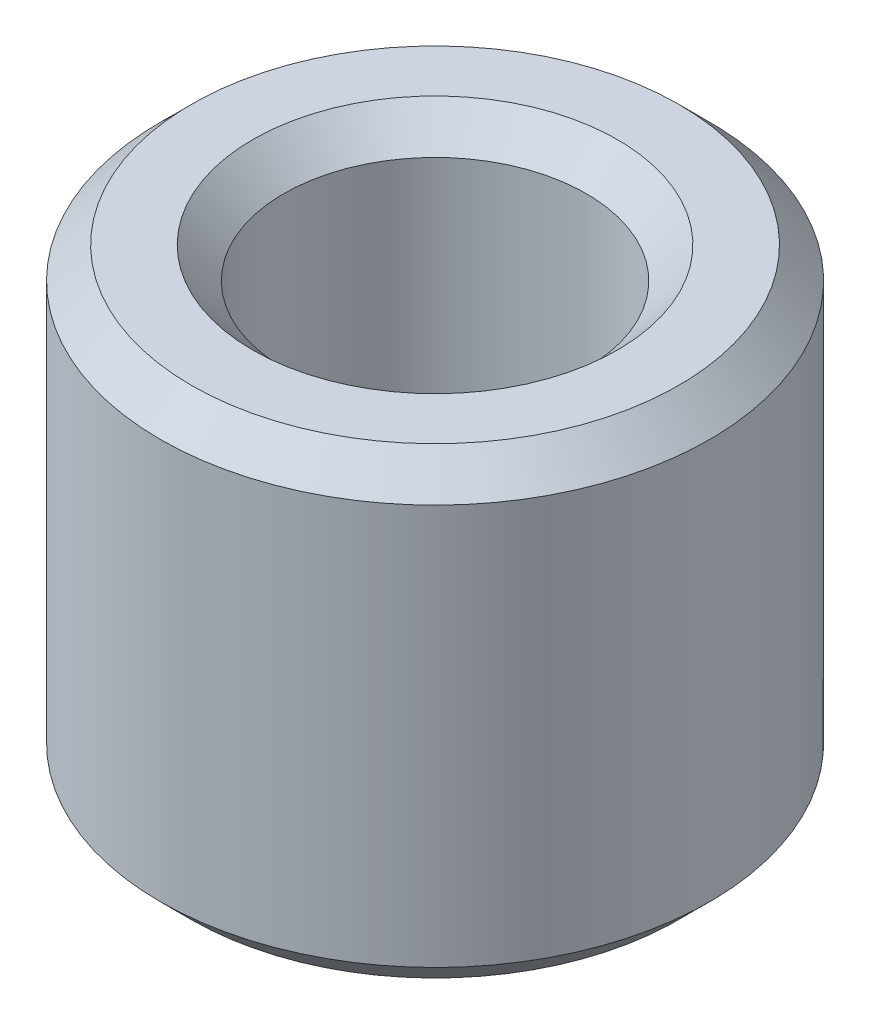
ISO-10303-21;
HEADER;
FILE_DESCRIPTION(('STEP AP214'),'2;1');
FILE_NAME('part.step','',(''),(''),'','','');
FILE_SCHEMA(('AUTOMOTIVE_DESIGN { 1 0 10303 214 1 1 1 1 }'));
ENDSEC;
DATA;
#1=APPLICATION_CONTEXT('core data for automotive mechanical design processes');
#2=APPLICATION_PROTOCOL_DEFINITION('international standard','automotive_design',2000,#1);
#3=PRODUCT_CONTEXT('',#1,'mechanical');
#4=PRODUCT('Part','Part','',(#3));
#5=PRODUCT_RELATED_PRODUCT_CATEGORY('part','',(#4));
#6=PRODUCT_DEFINITION_FORMATION('','',#4);
#7=PRODUCT_DEFINITION_CONTEXT('part definition',#1,'design');
#8=PRODUCT_DEFINITION('design','',#6,#7);
#9=PRODUCT_DEFINITION_SHAPE('','',#8);
#10=(LENGTH_UNIT() NAMED_UNIT(*) SI_UNIT(.MILLI.,.METRE.));
#11=(NAMED_UNIT(*) PLANE_ANGLE_UNIT() SI_UNIT($,.RADIAN.));
#12=(NAMED_UNIT(*) SI_UNIT($,.STERADIAN.) SOLID_ANGLE_UNIT());
#13=UNCERTAINTY_MEASURE_WITH_UNIT(LENGTH_MEASURE(1.E-05),#10,'distance_accuracy_value','');
#14=(GEOMETRIC_REPRESENTATION_CONTEXT(3) GLOBAL_UNCERTAINTY_ASSIGNED_CONTEXT((#13)) GLOBAL_UNIT_ASSIGNED_CONTEXT((#10,
#11,#12)) REPRESENTATION_CONTEXT('',''));
#15=CARTESIAN_POINT('',(0.,0.,0.));
#16=DIRECTION('',(0.,0.,1.));
#17=DIRECTION('',(1.,0.,0.));
#18=AXIS2_PLACEMENT_3D('',#15,#16,#17);
#19=CARTESIAN_POINT('',(0.,37.8962519873478,0.));
#20=DIRECTION('',(0.,-1.,0.));
#21=DIRECTION('',(0.,0.,-1.));
#22=AXIS2_PLACEMENT_3D('',#19,#20,#21);
#23=CYLINDRICAL_SURFACE('',#22,22.5);
#24=CARTESIAN_POINT('',(0.,2.55291042532784,0.));
#25=DIRECTION('',(0.,1.,0.));
#26=DIRECTION('',(0.,0.,1.));
#27=AXIS2_PLACEMENT_3D('',#24,#25,#26);
#28=CIRCLE('',#27,22.5);
#29=CARTESIAN_POINT('',(0.,2.55291042532784,22.5));
#30=VERTEX_POINT('',#29);
#31=EDGE_CURVE('E10',#30,#30,#28,.T.);
#32=ORIENTED_EDGE('',*,*,#31,.T.);
#33=EDGE_LOOP('',(#32));
#34=FACE_BOUND('',#33,.T.);
#35=CARTESIAN_POINT('',(0.,35.34334156202,0.));
#36=DIRECTION('',(0.,1.,0.));
#37=DIRECTION('',(0.,0.,1.));
#38=AXIS2_PLACEMENT_3D('',#35,#36,#37);
#39=CIRCLE('',#38,22.5);
#40=CARTESIAN_POINT('',(0.,35.34334156202,22.5));
#41=VERTEX_POINT('',#40);
#42=EDGE_CURVE('E50',#41,#41,#39,.F.);
#43=ORIENTED_EDGE('',*,*,#42,.T.);
#44=EDGE_LOOP('',(#43));
#45=FACE_BOUND('',#44,.T.);
#46=ADVANCED_FACE('F39',(#34,#45),#23,.T.);
#47=CARTESIAN_POINT('',(0.,37.8962519873478,0.));
#48=DIRECTION('',(0.,1.,0.));
#49=DIRECTION('',(0.,0.,1.));
#50=AXIS2_PLACEMENT_3D('',#47,#48,#49);
#51=PLANE('',#50);
#52=CARTESIAN_POINT('',(0.,37.8962519873478,0.));
#53=DIRECTION('',(0.,1.,0.));
#54=DIRECTION('',(0.,0.,1.));
#55=AXIS2_PLACEMENT_3D('',#52,#53,#54);
#56=CIRCLE('',#55,14.9329536300378);
#57=CARTESIAN_POINT('',(0.,37.8962519873478,14.9329536300378));
#58=VERTEX_POINT('',#57);
#59=EDGE_CURVE('E58',#58,#58,#56,.F.);
#60=ORIENTED_EDGE('',*,*,#59,.T.);
#61=EDGE_LOOP('',(#60));
#62=FACE_BOUND('',#61,.T.);
#63=CARTESIAN_POINT('',(0.,37.8962519873478,0.));
#64=DIRECTION('',(0.,1.,0.));
#65=DIRECTION('',(0.,0.,1.));
#66=AXIS2_PLACEMENT_3D('',#63,#64,#65);
#67=CIRCLE('',#66,19.9470895746721);
#68=CARTESIAN_POINT('',(0.,37.8962519873478,19.9470895746721));
#69=VERTEX_POINT('',#68);
#70=EDGE_CURVE('E61',#69,#69,#67,.T.);
#71=ORIENTED_EDGE('',*,*,#70,.T.);
#72=EDGE_LOOP('',(#71));
#73=FACE_BOUND('',#72,.T.);
#74=ADVANCED_FACE('F88',(#62,#73),#51,.T.);
#75=CARTESIAN_POINT('',(0.,0.,0.));
#76=DIRECTION('',(0.,1.,0.));
#77=DIRECTION('',(0.,0.,1.));
#78=AXIS2_PLACEMENT_3D('',#75,#76,#77);
#79=PLANE('',#78);
#80=CARTESIAN_POINT('',(0.,0.,0.));
#81=DIRECTION('',(0.,1.,0.));
#82=DIRECTION('',(0.,0.,1.));
#83=AXIS2_PLACEMENT_3D('',#80,#81,#82);
#84=CIRCLE('',#83,14.9329536300377);
#85=CARTESIAN_POINT('',(0.,0.,14.9329536300377));
#86=VERTEX_POINT('',#85);
#87=EDGE_CURVE('E51',#86,#86,#84,.T.);
#88=ORIENTED_EDGE('',*,*,#87,.T.);
#89=EDGE_LOOP('',(#88));
#90=FACE_BOUND('',#89,.T.);
#91=CARTESIAN_POINT('',(0.,0.,0.));
#92=DIRECTION('',(0.,1.,0.));
#93=DIRECTION('',(0.,0.,1.));
#94=AXIS2_PLACEMENT_3D('',#91,#92,#93);
#95=CIRCLE('',#94,19.9470895746721);
#96=CARTESIAN_POINT('',(0.,0.,19.9470895746721));
#97=VERTEX_POINT('',#96);
#98=EDGE_CURVE('E54',#97,#97,#95,.F.);
#99=ORIENTED_EDGE('',*,*,#98,.T.);
#100=EDGE_LOOP('',(#99));
#101=FACE_BOUND('',#100,.T.);
#102=ADVANCED_FACE('F83',(#90,#101),#79,.F.);
#103=CARTESIAN_POINT('',(0.,37.8962519873478,0.));
#104=DIRECTION('',(0.,-1.,0.));
#105=DIRECTION('',(0.,0.,-1.));
#106=AXIS2_PLACEMENT_3D('',#103,#104,#105);
#107=CYLINDRICAL_SURFACE('',#106,12.3800432047099);
#108=CARTESIAN_POINT('',(0.,35.34334156202,0.));
#109=DIRECTION('',(0.,1.,0.));
#110=DIRECTION('',(0.,0.,1.));
#111=AXIS2_PLACEMENT_3D('',#108,#109,#110);
#112=CIRCLE('',#111,12.3800432047099);
#113=CARTESIAN_POINT('',(0.,35.34334156202,12.3800432047099));
#114=VERTEX_POINT('',#113);
#115=EDGE_CURVE('E67',#114,#114,#112,.T.);
#116=ORIENTED_EDGE('',*,*,#115,.T.);
#117=EDGE_LOOP('',(#116));
#118=FACE_BOUND('',#117,.T.);
#119=CARTESIAN_POINT('',(0.,2.55291042532787,0.));
#120=DIRECTION('',(0.,1.,0.));
#121=DIRECTION('',(0.,0.,1.));
#122=AXIS2_PLACEMENT_3D('',#119,#120,#121);
#123=CIRCLE('',#122,12.3800432047099);
#124=CARTESIAN_POINT('',(0.,2.55291042532787,12.3800432047099));
#125=VERTEX_POINT('',#124);
#126=EDGE_CURVE('E69',#125,#125,#123,.F.);
#127=ORIENTED_EDGE('',*,*,#126,.T.);
#128=EDGE_LOOP('',(#127));
#129=FACE_BOUND('',#128,.T.);
#130=ADVANCED_FACE('F71',(#118,#129),#107,.F.);
#131=CARTESIAN_POINT('',(0.,35.34334156202,0.));
#132=DIRECTION('',(0.,1.,0.));
#133=DIRECTION('',(0.,0.,1.));
#134=AXIS2_PLACEMENT_3D('',#131,#132,#133);
#135=CONICAL_SURFACE('',#134,12.3800432047099,0.785398163397452);
#136=ORIENTED_EDGE('',*,*,#59,.F.);
#137=EDGE_LOOP('',(#136));
#138=FACE_BOUND('',#137,.T.);
#139=ORIENTED_EDGE('',*,*,#115,.F.);
#140=EDGE_LOOP('',(#139));
#141=FACE_BOUND('',#140,.T.);
#142=ADVANCED_FACE('F77',(#138,#141),#135,.F.);
#143=CARTESIAN_POINT('',(0.,0.,0.));
#144=DIRECTION('',(0.,-1.,0.));
#145=DIRECTION('',(0.,0.,-1.));
#146=AXIS2_PLACEMENT_3D('',#143,#144,#145);
#147=CONICAL_SURFACE('',#146,14.9329536300377,0.785398163397444);
#148=ORIENTED_EDGE('',*,*,#126,.F.);
#149=EDGE_LOOP('',(#148));
#150=FACE_BOUND('',#149,.T.);
#151=ORIENTED_EDGE('',*,*,#87,.F.);
#152=EDGE_LOOP('',(#151));
#153=FACE_BOUND('',#152,.T.);
#154=ADVANCED_FACE('F73',(#150,#153),#147,.F.);
#155=CARTESIAN_POINT('',(0.,2.55291042532784,0.));
#156=DIRECTION('',(0.,1.,0.));
#157=DIRECTION('',(0.,0.,1.));
#158=AXIS2_PLACEMENT_3D('',#155,#156,#157);
#159=CONICAL_SURFACE('',#158,22.5,0.785398163397452);
#160=ORIENTED_EDGE('',*,*,#98,.F.);
#161=EDGE_LOOP('',(#160));
#162=FACE_BOUND('',#161,.T.);
#163=ORIENTED_EDGE('',*,*,#31,.F.);
#164=EDGE_LOOP('',(#163));
#165=FACE_BOUND('',#164,.T.);
#166=ADVANCED_FACE('F76',(#162,#165),#159,.T.);
#167=CARTESIAN_POINT('',(0.,37.8962519873478,0.));
#168=DIRECTION('',(0.,-1.,0.));
#169=DIRECTION('',(0.,0.,-1.));
#170=AXIS2_PLACEMENT_3D('',#167,#168,#169);
#171=CONICAL_SURFACE('',#170,19.9470895746721,0.785398163397446);
#172=ORIENTED_EDGE('',*,*,#42,.F.);
#173=EDGE_LOOP('',(#172));
#174=FACE_BOUND('',#173,.T.);
#175=ORIENTED_EDGE('',*,*,#70,.F.);
#176=EDGE_LOOP('',(#175));
#177=FACE_BOUND('',#176,.T.);
#178=ADVANCED_FACE('F45',(#174,#177),#171,.T.);
#179=CLOSED_SHELL('',(#46,#74,#102,#130,#142,#154,#166,#178));
#180=MANIFOLD_SOLID_BREP('B2',#179);
#181=ADVANCED_BREP_SHAPE_REPRESENTATION('',(#18,#180),#14);
#182=SHAPE_DEFINITION_REPRESENTATION(#9,#181);
ENDSEC;
END-ISO-10303-21;
